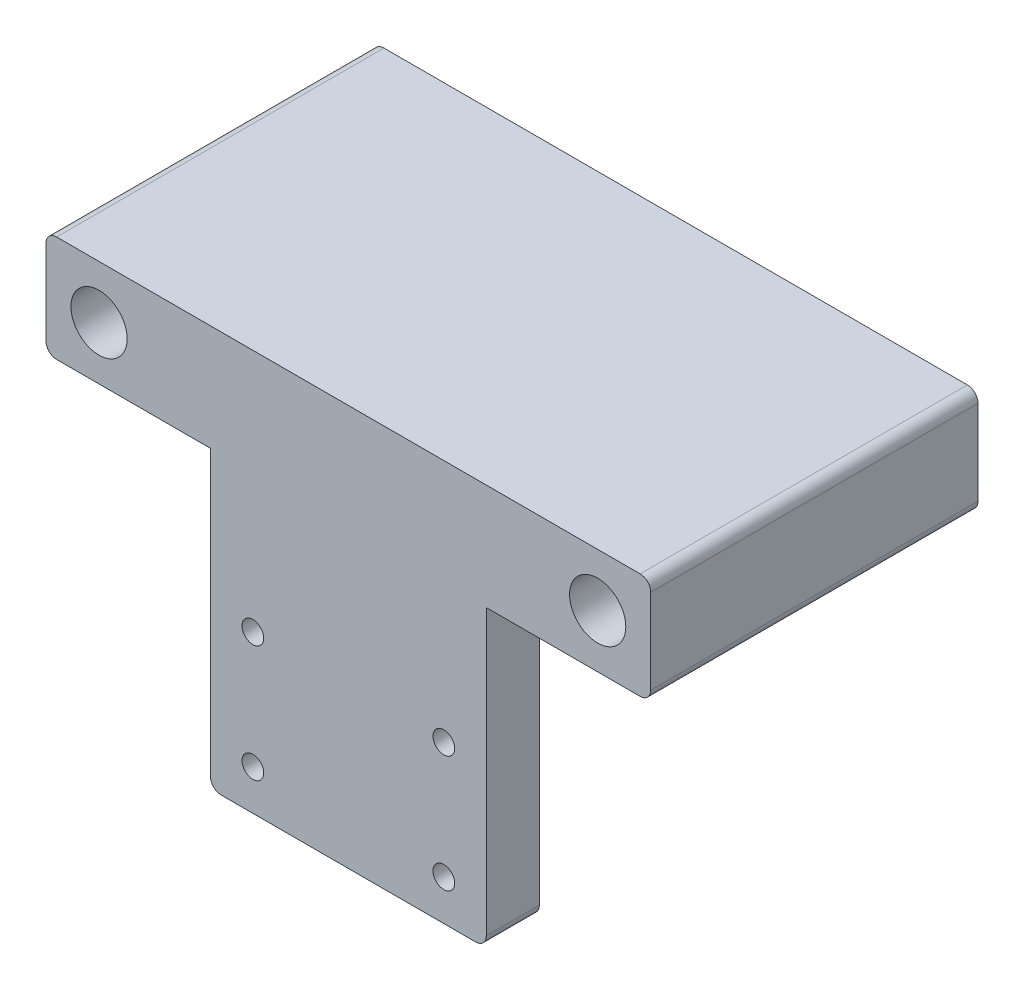
ISO-10303-21;
HEADER;
FILE_DESCRIPTION(('STEP AP214'),'2;1');
FILE_NAME('part.step','',(''),(''),'','','');
FILE_SCHEMA(('AUTOMOTIVE_DESIGN { 1 0 10303 214 1 1 1 1 }'));
ENDSEC;
DATA;
#1=APPLICATION_CONTEXT('core data for automotive mechanical design processes');
#2=APPLICATION_PROTOCOL_DEFINITION('international standard','automotive_design',2000,#1);
#3=PRODUCT_CONTEXT('',#1,'mechanical');
#4=PRODUCT('Part','Part','',(#3));
#5=PRODUCT_RELATED_PRODUCT_CATEGORY('part','',(#4));
#6=PRODUCT_DEFINITION_FORMATION('','',#4);
#7=PRODUCT_DEFINITION_CONTEXT('part definition',#1,'design');
#8=PRODUCT_DEFINITION('design','',#6,#7);
#9=PRODUCT_DEFINITION_SHAPE('','',#8);
#10=(LENGTH_UNIT() NAMED_UNIT(*) SI_UNIT(.MILLI.,.METRE.));
#11=(NAMED_UNIT(*) PLANE_ANGLE_UNIT() SI_UNIT($,.RADIAN.));
#12=(NAMED_UNIT(*) SI_UNIT($,.STERADIAN.) SOLID_ANGLE_UNIT());
#13=UNCERTAINTY_MEASURE_WITH_UNIT(LENGTH_MEASURE(1.E-05),#10,'distance_accuracy_value','');
#14=(GEOMETRIC_REPRESENTATION_CONTEXT(3) GLOBAL_UNCERTAINTY_ASSIGNED_CONTEXT((#13)) GLOBAL_UNIT_ASSIGNED_CONTEXT((#10,
#11,#12)) REPRESENTATION_CONTEXT('',''));
#15=CARTESIAN_POINT('',(0.,0.,0.));
#16=DIRECTION('',(0.,0.,1.));
#17=DIRECTION('',(1.,0.,0.));
#18=AXIS2_PLACEMENT_3D('',#15,#16,#17);
#19=CARTESIAN_POINT('',(13.,0.,5.));
#20=DIRECTION('',(-1.,0.,0.));
#21=DIRECTION('',(0.,0.,1.));
#22=AXIS2_PLACEMENT_3D('',#19,#20,#21);
#23=PLANE('',#22);
#24=DIRECTION('',(0.,1.,0.));
#25=VECTOR('',#24,1.);
#26=CARTESIAN_POINT('',(13.,0.,5.));
#27=LINE('',#26,#25);
#28=CARTESIAN_POINT('',(13.,-8.3,5.));
#29=VERTEX_POINT('',#28);
#30=CARTESIAN_POINT('',(13.,18.5,5.));
#31=VERTEX_POINT('',#30);
#32=EDGE_CURVE('E162',#29,#31,#27,.T.);
#33=ORIENTED_EDGE('',*,*,#32,.F.);
#34=DIRECTION('',(0.,0.,-1.));
#35=VECTOR('',#34,1.);
#36=CARTESIAN_POINT('',(13.,-8.3,5.));
#37=LINE('',#36,#35);
#38=CARTESIAN_POINT('',(13.,-8.3,0.));
#39=VERTEX_POINT('',#38);
#40=EDGE_CURVE('E204',#29,#39,#37,.T.);
#41=ORIENTED_EDGE('',*,*,#40,.T.);
#42=DIRECTION('',(0.,1.,0.));
#43=VECTOR('',#42,1.);
#44=CARTESIAN_POINT('',(13.,0.,0.));
#45=LINE('',#44,#43);
#46=CARTESIAN_POINT('',(13.,18.5,0.));
#47=VERTEX_POINT('',#46);
#48=EDGE_CURVE('E160',#39,#47,#45,.T.);
#49=ORIENTED_EDGE('',*,*,#48,.T.);
#50=DIRECTION('',(0.,0.,-1.));
#51=VECTOR('',#50,1.);
#52=CARTESIAN_POINT('',(13.,18.5,5.));
#53=LINE('',#52,#51);
#54=EDGE_CURVE('E145',#31,#47,#53,.T.);
#55=ORIENTED_EDGE('',*,*,#54,.F.);
#56=EDGE_LOOP('',(#33,#41,#49,#55));
#57=FACE_BOUND('',#56,.T.);
#58=ADVANCED_FACE('F34',(#57),#23,.F.);
#59=CARTESIAN_POINT('',(28.5,0.,5.));
#60=DIRECTION('',(-1.,0.,0.));
#61=DIRECTION('',(0.,0.,1.));
#62=AXIS2_PLACEMENT_3D('',#59,#60,#61);
#63=PLANE('',#62);
#64=DIRECTION('',(0.,1.,0.));
#65=VECTOR('',#64,1.);
#66=CARTESIAN_POINT('',(28.5,0.,5.));
#67=LINE('',#66,#65);
#68=CARTESIAN_POINT('',(28.5,19.5,5.));
#69=VERTEX_POINT('',#68);
#70=CARTESIAN_POINT('',(28.5,27.5,5.));
#71=VERTEX_POINT('',#70);
#72=EDGE_CURVE('E240',#69,#71,#67,.T.);
#73=ORIENTED_EDGE('',*,*,#72,.F.);
#74=DIRECTION('',(0.,0.,-1.));
#75=VECTOR('',#74,1.);
#76=CARTESIAN_POINT('',(28.5,19.5,5.));
#77=LINE('',#76,#75);
#78=CARTESIAN_POINT('',(28.5,19.5,-25.85));
#79=VERTEX_POINT('',#78);
#80=EDGE_CURVE('E201',#69,#79,#77,.T.);
#81=ORIENTED_EDGE('',*,*,#80,.T.);
#82=DIRECTION('',(0.,1.,0.));
#83=VECTOR('',#82,1.);
#84=CARTESIAN_POINT('',(28.5,0.,-25.85));
#85=LINE('',#84,#83);
#86=CARTESIAN_POINT('',(28.5,27.5,-25.85));
#87=VERTEX_POINT('',#86);
#88=EDGE_CURVE('E248',#79,#87,#85,.T.);
#89=ORIENTED_EDGE('',*,*,#88,.T.);
#90=DIRECTION('',(0.,0.,-1.));
#91=VECTOR('',#90,1.);
#92=CARTESIAN_POINT('',(28.5,27.5,5.));
#93=LINE('',#92,#91);
#94=EDGE_CURVE('E199',#87,#71,#93,.F.);
#95=ORIENTED_EDGE('',*,*,#94,.T.);
#96=EDGE_LOOP('',(#73,#81,#89,#95));
#97=FACE_BOUND('',#96,.T.);
#98=ADVANCED_FACE('F324',(#97),#63,.F.);
#99=CARTESIAN_POINT('',(0.,28.5,5.));
#100=DIRECTION('',(0.,1.,0.));
#101=DIRECTION('',(0.,0.,1.));
#102=AXIS2_PLACEMENT_3D('',#99,#100,#101);
#103=PLANE('',#102);
#104=DIRECTION('',(1.,0.,0.));
#105=VECTOR('',#104,1.);
#106=CARTESIAN_POINT('',(0.,28.5,-25.85));
#107=LINE('',#106,#105);
#108=CARTESIAN_POINT('',(-27.5,28.5,-25.85));
#109=VERTEX_POINT('',#108);
#110=CARTESIAN_POINT('',(27.5,28.5,-25.85));
#111=VERTEX_POINT('',#110);
#112=EDGE_CURVE('E245',#109,#111,#107,.T.);
#113=ORIENTED_EDGE('',*,*,#112,.F.);
#114=DIRECTION('',(0.,0.,-1.));
#115=VECTOR('',#114,1.);
#116=CARTESIAN_POINT('',(-27.5,28.5,5.));
#117=LINE('',#116,#115);
#118=CARTESIAN_POINT('',(-27.5,28.5,5.));
#119=VERTEX_POINT('',#118);
#120=EDGE_CURVE('E197',#109,#119,#117,.F.);
#121=ORIENTED_EDGE('',*,*,#120,.T.);
#122=DIRECTION('',(1.,0.,0.));
#123=VECTOR('',#122,1.);
#124=CARTESIAN_POINT('',(0.,28.5,5.));
#125=LINE('',#124,#123);
#126=CARTESIAN_POINT('',(27.5,28.5,5.));
#127=VERTEX_POINT('',#126);
#128=EDGE_CURVE('E237',#119,#127,#125,.T.);
#129=ORIENTED_EDGE('',*,*,#128,.T.);
#130=DIRECTION('',(0.,0.,-1.));
#131=VECTOR('',#130,1.);
#132=CARTESIAN_POINT('',(27.5,28.5,-25.85));
#133=LINE('',#132,#131);
#134=EDGE_CURVE('E194',#127,#111,#133,.T.);
#135=ORIENTED_EDGE('',*,*,#134,.T.);
#136=EDGE_LOOP('',(#113,#121,#129,#135));
#137=FACE_BOUND('',#136,.T.);
#138=ADVANCED_FACE('F329',(#137),#103,.T.);
#139=CARTESIAN_POINT('',(-28.5,0.,5.));
#140=DIRECTION('',(-1.,0.,0.));
#141=DIRECTION('',(0.,0.,1.));
#142=AXIS2_PLACEMENT_3D('',#139,#140,#141);
#143=PLANE('',#142);
#144=DIRECTION('',(0.,1.,0.));
#145=VECTOR('',#144,1.);
#146=CARTESIAN_POINT('',(-28.5,0.,-25.85));
#147=LINE('',#146,#145);
#148=CARTESIAN_POINT('',(-28.5,19.5,-25.85));
#149=VERTEX_POINT('',#148);
#150=CARTESIAN_POINT('',(-28.5,27.5,-25.85));
#151=VERTEX_POINT('',#150);
#152=EDGE_CURVE('E164',#149,#151,#147,.T.);
#153=ORIENTED_EDGE('',*,*,#152,.F.);
#154=DIRECTION('',(0.,0.,-1.));
#155=VECTOR('',#154,1.);
#156=CARTESIAN_POINT('',(-28.5,19.5,5.));
#157=LINE('',#156,#155);
#158=CARTESIAN_POINT('',(-28.5,19.5,5.));
#159=VERTEX_POINT('',#158);
#160=EDGE_CURVE('E184',#149,#159,#157,.F.);
#161=ORIENTED_EDGE('',*,*,#160,.T.);
#162=DIRECTION('',(0.,1.,0.));
#163=VECTOR('',#162,1.);
#164=CARTESIAN_POINT('',(-28.5,0.,5.));
#165=LINE('',#164,#163);
#166=CARTESIAN_POINT('',(-28.5,27.5,5.));
#167=VERTEX_POINT('',#166);
#168=EDGE_CURVE('E232',#159,#167,#165,.T.);
#169=ORIENTED_EDGE('',*,*,#168,.T.);
#170=DIRECTION('',(0.,0.,-1.));
#171=VECTOR('',#170,1.);
#172=CARTESIAN_POINT('',(-28.5,27.5,5.));
#173=LINE('',#172,#171);
#174=EDGE_CURVE('E181',#167,#151,#173,.T.);
#175=ORIENTED_EDGE('',*,*,#174,.T.);
#176=EDGE_LOOP('',(#153,#161,#169,#175));
#177=FACE_BOUND('',#176,.T.);
#178=ADVANCED_FACE('F441',(#177),#143,.T.);
#179=CARTESIAN_POINT('',(0.,18.5,5.));
#180=DIRECTION('',(0.,1.,0.));
#181=DIRECTION('',(0.,0.,1.));
#182=AXIS2_PLACEMENT_3D('',#179,#180,#181);
#183=PLANE('',#182);
#184=DIRECTION('',(1.,0.,0.));
#185=VECTOR('',#184,1.);
#186=CARTESIAN_POINT('',(0.,18.5,5.));
#187=LINE('',#186,#185);
#188=CARTESIAN_POINT('',(-27.5,18.5,5.));
#189=VERTEX_POINT('',#188);
#190=CARTESIAN_POINT('',(-13.,18.5,5.));
#191=VERTEX_POINT('',#190);
#192=EDGE_CURVE('E230',#189,#191,#187,.T.);
#193=ORIENTED_EDGE('',*,*,#192,.F.);
#194=DIRECTION('',(0.,0.,-1.));
#195=VECTOR('',#194,1.);
#196=CARTESIAN_POINT('',(-27.5,18.5,-25.85));
#197=LINE('',#196,#195);
#198=CARTESIAN_POINT('',(-27.5,18.5,-25.85));
#199=VERTEX_POINT('',#198);
#200=EDGE_CURVE('E170',#189,#199,#197,.T.);
#201=ORIENTED_EDGE('',*,*,#200,.T.);
#202=DIRECTION('',(1.,0.,0.));
#203=VECTOR('',#202,1.);
#204=CARTESIAN_POINT('',(0.,18.5,-25.85));
#205=LINE('',#204,#203);
#206=CARTESIAN_POINT('',(27.5,18.5,-25.85));
#207=VERTEX_POINT('',#206);
#208=EDGE_CURVE('E251',#199,#207,#205,.T.);
#209=ORIENTED_EDGE('',*,*,#208,.T.);
#210=DIRECTION('',(0.,0.,-1.));
#211=VECTOR('',#210,1.);
#212=CARTESIAN_POINT('',(27.5,18.5,5.));
#213=LINE('',#212,#211);
#214=CARTESIAN_POINT('',(27.5,18.5,5.));
#215=VERTEX_POINT('',#214);
#216=EDGE_CURVE('E149',#207,#215,#213,.F.);
#217=ORIENTED_EDGE('',*,*,#216,.T.);
#218=EDGE_CURVE('E223',#31,#215,#187,.T.);
#219=ORIENTED_EDGE('',*,*,#218,.F.);
#220=ORIENTED_EDGE('',*,*,#54,.T.);
#221=DIRECTION('',(1.,0.,0.));
#222=VECTOR('',#221,1.);
#223=CARTESIAN_POINT('',(0.,18.5,0.));
#224=LINE('',#223,#222);
#225=CARTESIAN_POINT('',(-13.,18.5,0.));
#226=VERTEX_POINT('',#225);
#227=EDGE_CURVE('E138',#226,#47,#224,.T.);
#228=ORIENTED_EDGE('',*,*,#227,.F.);
#229=DIRECTION('',(0.,0.,-1.));
#230=VECTOR('',#229,1.);
#231=CARTESIAN_POINT('',(-13.,18.5,5.));
#232=LINE('',#231,#230);
#233=EDGE_CURVE('E142',#191,#226,#232,.T.);
#234=ORIENTED_EDGE('',*,*,#233,.F.);
#235=EDGE_LOOP('',(#193,#201,#209,#217,#219,#220,#228,#234));
#236=FACE_BOUND('',#235,.T.);
#237=ADVANCED_FACE('F141',(#236),#183,.F.);
#238=CARTESIAN_POINT('',(-13.,0.,5.));
#239=DIRECTION('',(1.,0.,0.));
#240=DIRECTION('',(0.,0.,-1.));
#241=AXIS2_PLACEMENT_3D('',#238,#239,#240);
#242=PLANE('',#241);
#243=DIRECTION('',(0.,-1.,0.));
#244=VECTOR('',#243,1.);
#245=CARTESIAN_POINT('',(-13.,0.,0.));
#246=LINE('',#245,#244);
#247=CARTESIAN_POINT('',(-13.,-8.3,0.));
#248=VERTEX_POINT('',#247);
#249=EDGE_CURVE('E152',#226,#248,#246,.T.);
#250=ORIENTED_EDGE('',*,*,#249,.T.);
#251=DIRECTION('',(0.,0.,-1.));
#252=VECTOR('',#251,1.);
#253=CARTESIAN_POINT('',(-13.,-8.3,5.));
#254=LINE('',#253,#252);
#255=CARTESIAN_POINT('',(-13.,-8.3,5.));
#256=VERTEX_POINT('',#255);
#257=EDGE_CURVE('E11',#248,#256,#254,.F.);
#258=ORIENTED_EDGE('',*,*,#257,.T.);
#259=DIRECTION('',(0.,-1.,0.));
#260=VECTOR('',#259,1.);
#261=CARTESIAN_POINT('',(-13.,0.,5.));
#262=LINE('',#261,#260);
#263=EDGE_CURVE('E153',#191,#256,#262,.T.);
#264=ORIENTED_EDGE('',*,*,#263,.F.);
#265=ORIENTED_EDGE('',*,*,#233,.T.);
#266=EDGE_LOOP('',(#250,#258,#264,#265));
#267=FACE_BOUND('',#266,.T.);
#268=ADVANCED_FACE('F151',(#267),#242,.F.);
#269=CARTESIAN_POINT('',(0.,-9.3,5.));
#270=DIRECTION('',(0.,1.,0.));
#271=DIRECTION('',(0.,0.,1.));
#272=AXIS2_PLACEMENT_3D('',#269,#270,#271);
#273=PLANE('',#272);
#274=DIRECTION('',(1.,0.,0.));
#275=VECTOR('',#274,1.);
#276=CARTESIAN_POINT('',(0.,-9.3,0.));
#277=LINE('',#276,#275);
#278=CARTESIAN_POINT('',(-12.,-9.3,0.));
#279=VERTEX_POINT('',#278);
#280=CARTESIAN_POINT('',(12.,-9.3,0.));
#281=VERTEX_POINT('',#280);
#282=EDGE_CURVE('E159',#279,#281,#277,.T.);
#283=ORIENTED_EDGE('',*,*,#282,.T.);
#284=DIRECTION('',(0.,0.,-1.));
#285=VECTOR('',#284,1.);
#286=CARTESIAN_POINT('',(12.,-9.3,5.));
#287=LINE('',#286,#285);
#288=CARTESIAN_POINT('',(12.,-9.3,5.));
#289=VERTEX_POINT('',#288);
#290=EDGE_CURVE('E55',#281,#289,#287,.F.);
#291=ORIENTED_EDGE('',*,*,#290,.T.);
#292=DIRECTION('',(1.,0.,0.));
#293=VECTOR('',#292,1.);
#294=CARTESIAN_POINT('',(0.,-9.3,5.));
#295=LINE('',#294,#293);
#296=CARTESIAN_POINT('',(-12.,-9.3,5.));
#297=VERTEX_POINT('',#296);
#298=EDGE_CURVE('E154',#297,#289,#295,.T.);
#299=ORIENTED_EDGE('',*,*,#298,.F.);
#300=DIRECTION('',(0.,0.,-1.));
#301=VECTOR('',#300,1.);
#302=CARTESIAN_POINT('',(-12.,-9.3,5.));
#303=LINE('',#302,#301);
#304=EDGE_CURVE('E210',#297,#279,#303,.T.);
#305=ORIENTED_EDGE('',*,*,#304,.T.);
#306=EDGE_LOOP('',(#283,#291,#299,#305));
#307=FACE_BOUND('',#306,.T.);
#308=ADVANCED_FACE('F226',(#307),#273,.F.);
#309=CARTESIAN_POINT('',(0.,0.,5.));
#310=DIRECTION('',(0.,0.,1.));
#311=DIRECTION('',(1.,0.,0.));
#312=AXIS2_PLACEMENT_3D('',#309,#310,#311);
#313=PLANE('',#312);
#314=CARTESIAN_POINT('',(-9.,5.5,5.));
#315=DIRECTION('',(0.,0.,1.));
#316=DIRECTION('',(1.,0.,0.));
#317=AXIS2_PLACEMENT_3D('',#314,#315,#316);
#318=CIRCLE('',#317,1.025);
#319=CARTESIAN_POINT('',(-7.975,5.5,5.));
#320=VERTEX_POINT('',#319);
#321=EDGE_CURVE('E287',#320,#320,#318,.T.);
#322=ORIENTED_EDGE('',*,*,#321,.F.);
#323=EDGE_LOOP('',(#322));
#324=FACE_BOUND('',#323,.T.);
#325=CARTESIAN_POINT('',(-9.,-5.5,5.));
#326=DIRECTION('',(0.,0.,1.));
#327=DIRECTION('',(1.,0.,0.));
#328=AXIS2_PLACEMENT_3D('',#325,#326,#327);
#329=CIRCLE('',#328,1.025);
#330=CARTESIAN_POINT('',(-7.975,-5.5,5.));
#331=VERTEX_POINT('',#330);
#332=EDGE_CURVE('E281',#331,#331,#329,.T.);
#333=ORIENTED_EDGE('',*,*,#332,.F.);
#334=EDGE_LOOP('',(#333));
#335=FACE_BOUND('',#334,.T.);
#336=CARTESIAN_POINT('',(9.,-5.5,5.));
#337=DIRECTION('',(0.,0.,1.));
#338=DIRECTION('',(1.,0.,0.));
#339=AXIS2_PLACEMENT_3D('',#336,#337,#338);
#340=CIRCLE('',#339,1.025);
#341=CARTESIAN_POINT('',(10.025,-5.5,5.));
#342=VERTEX_POINT('',#341);
#343=EDGE_CURVE('E275',#342,#342,#340,.T.);
#344=ORIENTED_EDGE('',*,*,#343,.F.);
#345=EDGE_LOOP('',(#344));
#346=FACE_BOUND('',#345,.T.);
#347=CARTESIAN_POINT('',(9.,5.5,5.));
#348=DIRECTION('',(0.,0.,1.));
#349=DIRECTION('',(1.,0.,0.));
#350=AXIS2_PLACEMENT_3D('',#347,#348,#349);
#351=CIRCLE('',#350,1.025);
#352=CARTESIAN_POINT('',(10.025,5.5,5.));
#353=VERTEX_POINT('',#352);
#354=EDGE_CURVE('E269',#353,#353,#351,.T.);
#355=ORIENTED_EDGE('',*,*,#354,.F.);
#356=EDGE_LOOP('',(#355));
#357=FACE_BOUND('',#356,.T.);
#358=CARTESIAN_POINT('',(-23.5,23.5,5.));
#359=DIRECTION('',(0.,0.,1.));
#360=DIRECTION('',(1.,0.,0.));
#361=AXIS2_PLACEMENT_3D('',#358,#359,#360);
#362=CIRCLE('',#361,2.65);
#363=CARTESIAN_POINT('',(-20.85,23.5,5.));
#364=VERTEX_POINT('',#363);
#365=EDGE_CURVE('E263',#364,#364,#362,.T.);
#366=ORIENTED_EDGE('',*,*,#365,.F.);
#367=EDGE_LOOP('',(#366));
#368=FACE_BOUND('',#367,.T.);
#369=CARTESIAN_POINT('',(23.5,23.5,5.));
#370=DIRECTION('',(0.,0.,1.));
#371=DIRECTION('',(1.,0.,0.));
#372=AXIS2_PLACEMENT_3D('',#369,#370,#371);
#373=CIRCLE('',#372,2.65);
#374=CARTESIAN_POINT('',(26.15,23.5,5.));
#375=VERTEX_POINT('',#374);
#376=EDGE_CURVE('E257',#375,#375,#373,.T.);
#377=ORIENTED_EDGE('',*,*,#376,.F.);
#378=EDGE_LOOP('',(#377));
#379=FACE_BOUND('',#378,.T.);
#380=ORIENTED_EDGE('',*,*,#298,.T.);
#381=CARTESIAN_POINT('',(12.,-8.3,5.));
#382=DIRECTION('',(0.,0.,1.));
#383=DIRECTION('',(1.,0.,0.));
#384=AXIS2_PLACEMENT_3D('',#381,#382,#383);
#385=CIRCLE('',#384,1.);
#386=EDGE_CURVE('E42',#289,#29,#385,.T.);
#387=ORIENTED_EDGE('',*,*,#386,.T.);
#388=ORIENTED_EDGE('',*,*,#32,.T.);
#389=ORIENTED_EDGE('',*,*,#218,.T.);
#390=CARTESIAN_POINT('',(27.5,19.5,5.));
#391=DIRECTION('',(0.,0.,1.));
#392=DIRECTION('',(1.,0.,0.));
#393=AXIS2_PLACEMENT_3D('',#390,#391,#392);
#394=CIRCLE('',#393,1.);
#395=EDGE_CURVE('E188',#215,#69,#394,.T.);
#396=ORIENTED_EDGE('',*,*,#395,.T.);
#397=ORIENTED_EDGE('',*,*,#72,.T.);
#398=CARTESIAN_POINT('',(27.5,27.5,5.));
#399=DIRECTION('',(0.,0.,1.));
#400=DIRECTION('',(1.,0.,0.));
#401=AXIS2_PLACEMENT_3D('',#398,#399,#400);
#402=CIRCLE('',#401,1.);
#403=EDGE_CURVE('E186',#71,#127,#402,.T.);
#404=ORIENTED_EDGE('',*,*,#403,.T.);
#405=ORIENTED_EDGE('',*,*,#128,.F.);
#406=CARTESIAN_POINT('',(-27.5,27.5,5.));
#407=DIRECTION('',(0.,0.,1.));
#408=DIRECTION('',(1.,0.,0.));
#409=AXIS2_PLACEMENT_3D('',#406,#407,#408);
#410=CIRCLE('',#409,1.);
#411=EDGE_CURVE('E190',#119,#167,#410,.T.);
#412=ORIENTED_EDGE('',*,*,#411,.T.);
#413=ORIENTED_EDGE('',*,*,#168,.F.);
#414=CARTESIAN_POINT('',(-27.5,19.5,5.));
#415=DIRECTION('',(0.,0.,1.));
#416=DIRECTION('',(1.,0.,0.));
#417=AXIS2_PLACEMENT_3D('',#414,#415,#416);
#418=CIRCLE('',#417,1.);
#419=EDGE_CURVE('E192',#159,#189,#418,.T.);
#420=ORIENTED_EDGE('',*,*,#419,.T.);
#421=ORIENTED_EDGE('',*,*,#192,.T.);
#422=ORIENTED_EDGE('',*,*,#263,.T.);
#423=CARTESIAN_POINT('',(-12.,-8.3,5.));
#424=DIRECTION('',(0.,0.,1.));
#425=DIRECTION('',(1.,0.,0.));
#426=AXIS2_PLACEMENT_3D('',#423,#424,#425);
#427=CIRCLE('',#426,1.);
#428=EDGE_CURVE('E214',#256,#297,#427,.T.);
#429=ORIENTED_EDGE('',*,*,#428,.T.);
#430=EDGE_LOOP('',(#380,#387,#388,#389,#396,#397,#404,#405,#412,#413,#420,#421,#422,#429));
#431=FACE_BOUND('',#430,.T.);
#432=ADVANCED_FACE('F218',(#324,#335,#346,#357,#368,#379,#431),#313,.T.);
#433=CARTESIAN_POINT('',(0.,0.,0.));
#434=DIRECTION('',(0.,0.,1.));
#435=DIRECTION('',(1.,0.,0.));
#436=AXIS2_PLACEMENT_3D('',#433,#434,#435);
#437=PLANE('',#436);
#438=CARTESIAN_POINT('',(-9.,5.5,0.));
#439=DIRECTION('',(0.,0.,1.));
#440=DIRECTION('',(1.,0.,0.));
#441=AXIS2_PLACEMENT_3D('',#438,#439,#440);
#442=CIRCLE('',#441,1.025);
#443=CARTESIAN_POINT('',(-7.97500000000001,5.5,0.));
#444=VERTEX_POINT('',#443);
#445=EDGE_CURVE('E284',#444,#444,#442,.T.);
#446=ORIENTED_EDGE('',*,*,#445,.T.);
#447=EDGE_LOOP('',(#446));
#448=FACE_BOUND('',#447,.T.);
#449=CARTESIAN_POINT('',(-9.,-5.5,0.));
#450=DIRECTION('',(0.,0.,1.));
#451=DIRECTION('',(1.,0.,0.));
#452=AXIS2_PLACEMENT_3D('',#449,#450,#451);
#453=CIRCLE('',#452,1.025);
#454=CARTESIAN_POINT('',(-7.975,-5.5,0.));
#455=VERTEX_POINT('',#454);
#456=EDGE_CURVE('E278',#455,#455,#453,.T.);
#457=ORIENTED_EDGE('',*,*,#456,.T.);
#458=EDGE_LOOP('',(#457));
#459=FACE_BOUND('',#458,.T.);
#460=CARTESIAN_POINT('',(9.,-5.5,0.));
#461=DIRECTION('',(0.,0.,1.));
#462=DIRECTION('',(1.,0.,0.));
#463=AXIS2_PLACEMENT_3D('',#460,#461,#462);
#464=CIRCLE('',#463,1.025);
#465=CARTESIAN_POINT('',(10.025,-5.5,0.));
#466=VERTEX_POINT('',#465);
#467=EDGE_CURVE('E272',#466,#466,#464,.T.);
#468=ORIENTED_EDGE('',*,*,#467,.T.);
#469=EDGE_LOOP('',(#468));
#470=FACE_BOUND('',#469,.T.);
#471=CARTESIAN_POINT('',(9.,5.5,0.));
#472=DIRECTION('',(0.,0.,1.));
#473=DIRECTION('',(1.,0.,0.));
#474=AXIS2_PLACEMENT_3D('',#471,#472,#473);
#475=CIRCLE('',#474,1.025);
#476=CARTESIAN_POINT('',(10.025,5.5,0.));
#477=VERTEX_POINT('',#476);
#478=EDGE_CURVE('E266',#477,#477,#475,.T.);
#479=ORIENTED_EDGE('',*,*,#478,.T.);
#480=EDGE_LOOP('',(#479));
#481=FACE_BOUND('',#480,.T.);
#482=ORIENTED_EDGE('',*,*,#48,.F.);
#483=CARTESIAN_POINT('',(12.,-8.3,0.));
#484=DIRECTION('',(0.,0.,1.));
#485=DIRECTION('',(1.,0.,0.));
#486=AXIS2_PLACEMENT_3D('',#483,#484,#485);
#487=CIRCLE('',#486,1.);
#488=EDGE_CURVE('E208',#39,#281,#487,.F.);
#489=ORIENTED_EDGE('',*,*,#488,.T.);
#490=ORIENTED_EDGE('',*,*,#282,.F.);
#491=CARTESIAN_POINT('',(-12.,-8.3,0.));
#492=DIRECTION('',(0.,0.,1.));
#493=DIRECTION('',(1.,0.,0.));
#494=AXIS2_PLACEMENT_3D('',#491,#492,#493);
#495=CIRCLE('',#494,1.);
#496=EDGE_CURVE('E158',#279,#248,#495,.F.);
#497=ORIENTED_EDGE('',*,*,#496,.T.);
#498=ORIENTED_EDGE('',*,*,#249,.F.);
#499=ORIENTED_EDGE('',*,*,#227,.T.);
#500=EDGE_LOOP('',(#482,#489,#490,#497,#498,#499));
#501=FACE_BOUND('',#500,.T.);
#502=ADVANCED_FACE('F156',(#448,#459,#470,#481,#501),#437,.F.);
#503=CARTESIAN_POINT('',(0.,0.,-25.85));
#504=DIRECTION('',(0.,0.,1.));
#505=DIRECTION('',(1.,0.,0.));
#506=AXIS2_PLACEMENT_3D('',#503,#504,#505);
#507=PLANE('',#506);
#508=CARTESIAN_POINT('',(-23.5,23.5,-25.85));
#509=DIRECTION('',(0.,0.,1.));
#510=DIRECTION('',(1.,0.,0.));
#511=AXIS2_PLACEMENT_3D('',#508,#509,#510);
#512=CIRCLE('',#511,2.64999999999999);
#513=CARTESIAN_POINT('',(-20.85,23.5,-25.85));
#514=VERTEX_POINT('',#513);
#515=EDGE_CURVE('E260',#514,#514,#512,.T.);
#516=ORIENTED_EDGE('',*,*,#515,.T.);
#517=EDGE_LOOP('',(#516));
#518=FACE_BOUND('',#517,.T.);
#519=CARTESIAN_POINT('',(23.5,23.5,-25.85));
#520=DIRECTION('',(0.,0.,1.));
#521=DIRECTION('',(1.,0.,0.));
#522=AXIS2_PLACEMENT_3D('',#519,#520,#521);
#523=CIRCLE('',#522,2.64999999999999);
#524=CARTESIAN_POINT('',(26.15,23.5,-25.85));
#525=VERTEX_POINT('',#524);
#526=EDGE_CURVE('E254',#525,#525,#523,.T.);
#527=ORIENTED_EDGE('',*,*,#526,.T.);
#528=EDGE_LOOP('',(#527));
#529=FACE_BOUND('',#528,.T.);
#530=ORIENTED_EDGE('',*,*,#208,.F.);
#531=CARTESIAN_POINT('',(-27.5,19.5,-25.85));
#532=DIRECTION('',(0.,0.,1.));
#533=DIRECTION('',(1.,0.,0.));
#534=AXIS2_PLACEMENT_3D('',#531,#532,#533);
#535=CIRCLE('',#534,1.);
#536=EDGE_CURVE('E179',#199,#149,#535,.F.);
#537=ORIENTED_EDGE('',*,*,#536,.T.);
#538=ORIENTED_EDGE('',*,*,#152,.T.);
#539=CARTESIAN_POINT('',(-27.5,27.5,-25.85));
#540=DIRECTION('',(0.,0.,1.));
#541=DIRECTION('',(1.,0.,0.));
#542=AXIS2_PLACEMENT_3D('',#539,#540,#541);
#543=CIRCLE('',#542,1.);
#544=EDGE_CURVE('E177',#151,#109,#543,.F.);
#545=ORIENTED_EDGE('',*,*,#544,.T.);
#546=ORIENTED_EDGE('',*,*,#112,.T.);
#547=CARTESIAN_POINT('',(27.5,27.5,-25.85));
#548=DIRECTION('',(0.,0.,1.));
#549=DIRECTION('',(1.,0.,0.));
#550=AXIS2_PLACEMENT_3D('',#547,#548,#549);
#551=CIRCLE('',#550,1.);
#552=EDGE_CURVE('E173',#111,#87,#551,.F.);
#553=ORIENTED_EDGE('',*,*,#552,.T.);
#554=ORIENTED_EDGE('',*,*,#88,.F.);
#555=CARTESIAN_POINT('',(27.5,19.5,-25.85));
#556=DIRECTION('',(0.,0.,1.));
#557=DIRECTION('',(1.,0.,0.));
#558=AXIS2_PLACEMENT_3D('',#555,#556,#557);
#559=CIRCLE('',#558,1.);
#560=EDGE_CURVE('E175',#79,#207,#559,.F.);
#561=ORIENTED_EDGE('',*,*,#560,.T.);
#562=EDGE_LOOP('',(#530,#537,#538,#545,#546,#553,#554,#561));
#563=FACE_BOUND('',#562,.T.);
#564=ADVANCED_FACE('F310',(#518,#529,#563),#507,.F.);
#565=CARTESIAN_POINT('',(23.5,23.5,5.));
#566=DIRECTION('',(0.,0.,1.));
#567=DIRECTION('',(1.,0.,0.));
#568=AXIS2_PLACEMENT_3D('',#565,#566,#567);
#569=CYLINDRICAL_SURFACE('',#568,2.64999999999999);
#570=ORIENTED_EDGE('',*,*,#526,.F.);
#571=EDGE_LOOP('',(#570));
#572=FACE_BOUND('',#571,.T.);
#573=ORIENTED_EDGE('',*,*,#376,.T.);
#574=EDGE_LOOP('',(#573));
#575=FACE_BOUND('',#574,.T.);
#576=ADVANCED_FACE('F307',(#572,#575),#569,.F.);
#577=CARTESIAN_POINT('',(-23.5,23.5,5.));
#578=DIRECTION('',(0.,0.,1.));
#579=DIRECTION('',(1.,0.,0.));
#580=AXIS2_PLACEMENT_3D('',#577,#578,#579);
#581=CYLINDRICAL_SURFACE('',#580,2.64999999999999);
#582=ORIENTED_EDGE('',*,*,#515,.F.);
#583=EDGE_LOOP('',(#582));
#584=FACE_BOUND('',#583,.T.);
#585=ORIENTED_EDGE('',*,*,#365,.T.);
#586=EDGE_LOOP('',(#585));
#587=FACE_BOUND('',#586,.T.);
#588=ADVANCED_FACE('F309',(#584,#587),#581,.F.);
#589=CARTESIAN_POINT('',(9.,5.5,5.));
#590=DIRECTION('',(0.,0.,1.));
#591=DIRECTION('',(1.,0.,0.));
#592=AXIS2_PLACEMENT_3D('',#589,#590,#591);
#593=CYLINDRICAL_SURFACE('',#592,1.025);
#594=ORIENTED_EDGE('',*,*,#354,.T.);
#595=EDGE_LOOP('',(#594));
#596=FACE_BOUND('',#595,.T.);
#597=ORIENTED_EDGE('',*,*,#478,.F.);
#598=EDGE_LOOP('',(#597));
#599=FACE_BOUND('',#598,.T.);
#600=ADVANCED_FACE('F317',(#596,#599),#593,.F.);
#601=CARTESIAN_POINT('',(9.,-5.5,5.));
#602=DIRECTION('',(0.,0.,1.));
#603=DIRECTION('',(1.,0.,0.));
#604=AXIS2_PLACEMENT_3D('',#601,#602,#603);
#605=CYLINDRICAL_SURFACE('',#604,1.025);
#606=ORIENTED_EDGE('',*,*,#343,.T.);
#607=EDGE_LOOP('',(#606));
#608=FACE_BOUND('',#607,.T.);
#609=ORIENTED_EDGE('',*,*,#467,.F.);
#610=EDGE_LOOP('',(#609));
#611=FACE_BOUND('',#610,.T.);
#612=ADVANCED_FACE('F485',(#608,#611),#605,.F.);
#613=CARTESIAN_POINT('',(-9.,-5.5,5.));
#614=DIRECTION('',(0.,0.,1.));
#615=DIRECTION('',(1.,0.,0.));
#616=AXIS2_PLACEMENT_3D('',#613,#614,#615);
#617=CYLINDRICAL_SURFACE('',#616,1.025);
#618=ORIENTED_EDGE('',*,*,#332,.T.);
#619=EDGE_LOOP('',(#618));
#620=FACE_BOUND('',#619,.T.);
#621=ORIENTED_EDGE('',*,*,#456,.F.);
#622=EDGE_LOOP('',(#621));
#623=FACE_BOUND('',#622,.T.);
#624=ADVANCED_FACE('F476',(#620,#623),#617,.F.);
#625=CARTESIAN_POINT('',(-9.,5.5,5.));
#626=DIRECTION('',(0.,0.,1.));
#627=DIRECTION('',(1.,0.,0.));
#628=AXIS2_PLACEMENT_3D('',#625,#626,#627);
#629=CYLINDRICAL_SURFACE('',#628,1.025);
#630=ORIENTED_EDGE('',*,*,#321,.T.);
#631=EDGE_LOOP('',(#630));
#632=FACE_BOUND('',#631,.T.);
#633=ORIENTED_EDGE('',*,*,#445,.F.);
#634=EDGE_LOOP('',(#633));
#635=FACE_BOUND('',#634,.T.);
#636=ADVANCED_FACE('F291',(#632,#635),#629,.F.);
#637=CARTESIAN_POINT('',(-27.5,19.5,5.));
#638=DIRECTION('',(0.,0.,1.));
#639=DIRECTION('',(1.,0.,0.));
#640=AXIS2_PLACEMENT_3D('',#637,#638,#639);
#641=CYLINDRICAL_SURFACE('',#640,1.);
#642=ORIENTED_EDGE('',*,*,#419,.F.);
#643=ORIENTED_EDGE('',*,*,#160,.F.);
#644=ORIENTED_EDGE('',*,*,#536,.F.);
#645=ORIENTED_EDGE('',*,*,#200,.F.);
#646=EDGE_LOOP('',(#642,#643,#644,#645));
#647=FACE_BOUND('',#646,.T.);
#648=ADVANCED_FACE('F334',(#647),#641,.T.);
#649=CARTESIAN_POINT('',(-27.5,27.5,5.));
#650=DIRECTION('',(0.,0.,-1.));
#651=DIRECTION('',(-1.,0.,0.));
#652=AXIS2_PLACEMENT_3D('',#649,#650,#651);
#653=CYLINDRICAL_SURFACE('',#652,1.);
#654=ORIENTED_EDGE('',*,*,#411,.F.);
#655=ORIENTED_EDGE('',*,*,#120,.F.);
#656=ORIENTED_EDGE('',*,*,#544,.F.);
#657=ORIENTED_EDGE('',*,*,#174,.F.);
#658=EDGE_LOOP('',(#654,#655,#656,#657));
#659=FACE_BOUND('',#658,.T.);
#660=ADVANCED_FACE('F337',(#659),#653,.T.);
#661=CARTESIAN_POINT('',(27.5,19.5,5.));
#662=DIRECTION('',(0.,0.,-1.));
#663=DIRECTION('',(-1.,0.,0.));
#664=AXIS2_PLACEMENT_3D('',#661,#662,#663);
#665=CYLINDRICAL_SURFACE('',#664,1.);
#666=ORIENTED_EDGE('',*,*,#395,.F.);
#667=ORIENTED_EDGE('',*,*,#216,.F.);
#668=ORIENTED_EDGE('',*,*,#560,.F.);
#669=ORIENTED_EDGE('',*,*,#80,.F.);
#670=EDGE_LOOP('',(#666,#667,#668,#669));
#671=FACE_BOUND('',#670,.T.);
#672=ADVANCED_FACE('F341',(#671),#665,.T.);
#673=CARTESIAN_POINT('',(27.5,27.5,5.));
#674=DIRECTION('',(0.,0.,1.));
#675=DIRECTION('',(1.,0.,0.));
#676=AXIS2_PLACEMENT_3D('',#673,#674,#675);
#677=CYLINDRICAL_SURFACE('',#676,1.);
#678=ORIENTED_EDGE('',*,*,#403,.F.);
#679=ORIENTED_EDGE('',*,*,#94,.F.);
#680=ORIENTED_EDGE('',*,*,#552,.F.);
#681=ORIENTED_EDGE('',*,*,#134,.F.);
#682=EDGE_LOOP('',(#678,#679,#680,#681));
#683=FACE_BOUND('',#682,.T.);
#684=ADVANCED_FACE('F345',(#683),#677,.T.);
#685=CARTESIAN_POINT('',(12.,-8.3,5.));
#686=DIRECTION('',(0.,0.,-1.));
#687=DIRECTION('',(-1.,0.,0.));
#688=AXIS2_PLACEMENT_3D('',#685,#686,#687);
#689=CYLINDRICAL_SURFACE('',#688,1.);
#690=ORIENTED_EDGE('',*,*,#386,.F.);
#691=ORIENTED_EDGE('',*,*,#290,.F.);
#692=ORIENTED_EDGE('',*,*,#488,.F.);
#693=ORIENTED_EDGE('',*,*,#40,.F.);
#694=EDGE_LOOP('',(#690,#691,#692,#693));
#695=FACE_BOUND('',#694,.T.);
#696=ADVANCED_FACE('F225',(#695),#689,.T.);
#697=CARTESIAN_POINT('',(-12.,-8.3,5.));
#698=DIRECTION('',(0.,0.,-1.));
#699=DIRECTION('',(-1.,0.,0.));
#700=AXIS2_PLACEMENT_3D('',#697,#698,#699);
#701=CYLINDRICAL_SURFACE('',#700,1.);
#702=ORIENTED_EDGE('',*,*,#428,.F.);
#703=ORIENTED_EDGE('',*,*,#257,.F.);
#704=ORIENTED_EDGE('',*,*,#496,.F.);
#705=ORIENTED_EDGE('',*,*,#304,.F.);
#706=EDGE_LOOP('',(#702,#703,#704,#705));
#707=FACE_BOUND('',#706,.T.);
#708=ADVANCED_FACE('F36',(#707),#701,.T.);
#709=CLOSED_SHELL('',(#58,#98,#138,#178,#237,#268,#308,#432,#502,#564,#576,#588,#600,#612,#624,
#636,#648,#660,#672,#684,#696,#708));
#710=MANIFOLD_SOLID_BREP('B2',#709);
#711=ADVANCED_BREP_SHAPE_REPRESENTATION('',(#18,#710),#14);
#712=SHAPE_DEFINITION_REPRESENTATION(#9,#711);
ENDSEC;
END-ISO-10303-21;
